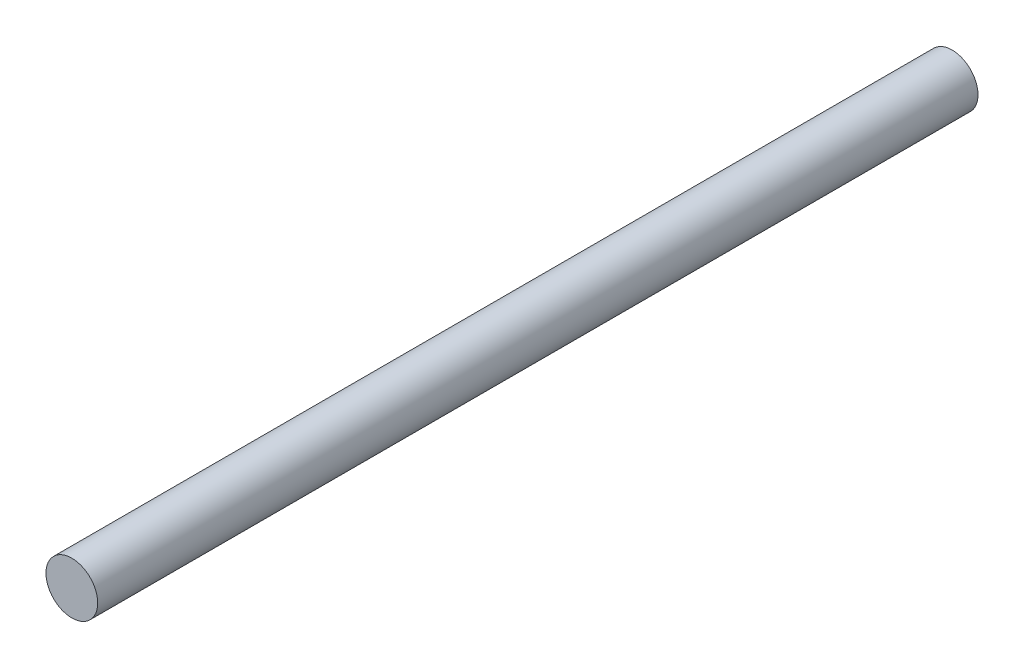
ISO-10303-21;
HEADER;
FILE_DESCRIPTION(('STEP AP214'),'2;1');
FILE_NAME('part.step','',(''),(''),'','','');
FILE_SCHEMA(('AUTOMOTIVE_DESIGN { 1 0 10303 214 1 1 1 1 }'));
ENDSEC;
DATA;
#1=APPLICATION_CONTEXT('core data for automotive mechanical design processes');
#2=APPLICATION_PROTOCOL_DEFINITION('international standard','automotive_design',2000,#1);
#3=PRODUCT_CONTEXT('',#1,'mechanical');
#4=PRODUCT('Part','Part','',(#3));
#5=PRODUCT_RELATED_PRODUCT_CATEGORY('part','',(#4));
#6=PRODUCT_DEFINITION_FORMATION('','',#4);
#7=PRODUCT_DEFINITION_CONTEXT('part definition',#1,'design');
#8=PRODUCT_DEFINITION('design','',#6,#7);
#9=PRODUCT_DEFINITION_SHAPE('','',#8);
#10=(LENGTH_UNIT() NAMED_UNIT(*) SI_UNIT(.MILLI.,.METRE.));
#11=(NAMED_UNIT(*) PLANE_ANGLE_UNIT() SI_UNIT($,.RADIAN.));
#12=(NAMED_UNIT(*) SI_UNIT($,.STERADIAN.) SOLID_ANGLE_UNIT());
#13=UNCERTAINTY_MEASURE_WITH_UNIT(LENGTH_MEASURE(1.E-05),#10,'distance_accuracy_value','');
#14=(GEOMETRIC_REPRESENTATION_CONTEXT(3) GLOBAL_UNCERTAINTY_ASSIGNED_CONTEXT((#13)) GLOBAL_UNIT_ASSIGNED_CONTEXT((#10,
#11,#12)) REPRESENTATION_CONTEXT('',''));
#15=CARTESIAN_POINT('',(0.,0.,0.));
#16=DIRECTION('',(0.,0.,1.));
#17=DIRECTION('',(1.,0.,0.));
#18=AXIS2_PLACEMENT_3D('',#15,#16,#17);
#19=CARTESIAN_POINT('',(0.,0.,215.9));
#20=DIRECTION('',(0.,0.,-1.));
#21=DIRECTION('',(-1.,0.,0.));
#22=AXIS2_PLACEMENT_3D('',#19,#20,#21);
#23=CYLINDRICAL_SURFACE('',#22,6.35);
#24=CARTESIAN_POINT('',(0.,0.,215.9));
#25=DIRECTION('',(0.,0.,1.));
#26=DIRECTION('',(1.,0.,0.));
#27=AXIS2_PLACEMENT_3D('',#24,#25,#26);
#28=CIRCLE('',#27,6.35);
#29=CARTESIAN_POINT('',(6.35,0.,215.9));
#30=VERTEX_POINT('',#29);
#31=EDGE_CURVE('E10',#30,#30,#28,.T.);
#32=ORIENTED_EDGE('',*,*,#31,.F.);
#33=EDGE_LOOP('',(#32));
#34=FACE_BOUND('',#33,.T.);
#35=CARTESIAN_POINT('',(0.,0.,0.));
#36=DIRECTION('',(0.,0.,1.));
#37=DIRECTION('',(1.,0.,0.));
#38=AXIS2_PLACEMENT_3D('',#35,#36,#37);
#39=CIRCLE('',#38,6.35);
#40=CARTESIAN_POINT('',(6.35,0.,0.));
#41=VERTEX_POINT('',#40);
#42=EDGE_CURVE('E32',#41,#41,#39,.T.);
#43=ORIENTED_EDGE('',*,*,#42,.T.);
#44=EDGE_LOOP('',(#43));
#45=FACE_BOUND('',#44,.T.);
#46=ADVANCED_FACE('F29',(#34,#45),#23,.T.);
#47=CARTESIAN_POINT('',(0.,0.,215.9));
#48=DIRECTION('',(0.,0.,1.));
#49=DIRECTION('',(1.,0.,0.));
#50=AXIS2_PLACEMENT_3D('',#47,#48,#49);
#51=PLANE('',#50);
#52=ORIENTED_EDGE('',*,*,#31,.T.);
#53=EDGE_LOOP('',(#52));
#54=FACE_BOUND('',#53,.T.);
#55=ADVANCED_FACE('F44',(#54),#51,.T.);
#56=CARTESIAN_POINT('',(0.,0.,0.));
#57=DIRECTION('',(0.,0.,1.));
#58=DIRECTION('',(1.,0.,0.));
#59=AXIS2_PLACEMENT_3D('',#56,#57,#58);
#60=PLANE('',#59);
#61=ORIENTED_EDGE('',*,*,#42,.F.);
#62=EDGE_LOOP('',(#61));
#63=FACE_BOUND('',#62,.T.);
#64=ADVANCED_FACE('F42',(#63),#60,.F.);
#65=CLOSED_SHELL('',(#46,#55,#64));
#66=MANIFOLD_SOLID_BREP('B2',#65);
#67=ADVANCED_BREP_SHAPE_REPRESENTATION('',(#18,#66),#14);
#68=SHAPE_DEFINITION_REPRESENTATION(#9,#67);
ENDSEC;
END-ISO-10303-21;
